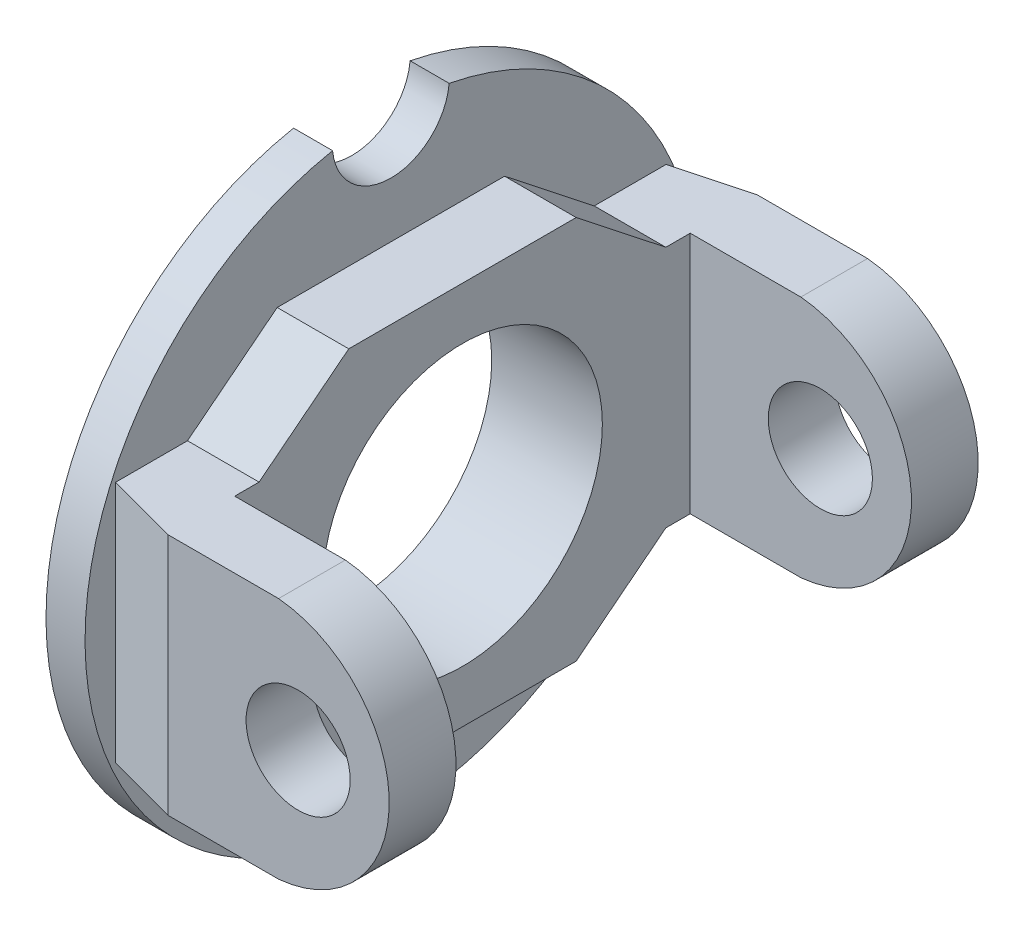
ISO-10303-21;
HEADER;
FILE_DESCRIPTION(('STEP AP214'),'2;1');
FILE_NAME('part.step','',(''),(''),'','','');
FILE_SCHEMA(('AUTOMOTIVE_DESIGN { 1 0 10303 214 1 1 1 1 }'));
ENDSEC;
DATA;
#1=APPLICATION_CONTEXT('core data for automotive mechanical design processes');
#2=APPLICATION_PROTOCOL_DEFINITION('international standard','automotive_design',2000,#1);
#3=PRODUCT_CONTEXT('',#1,'mechanical');
#4=PRODUCT('Part','Part','',(#3));
#5=PRODUCT_RELATED_PRODUCT_CATEGORY('part','',(#4));
#6=PRODUCT_DEFINITION_FORMATION('','',#4);
#7=PRODUCT_DEFINITION_CONTEXT('part definition',#1,'design');
#8=PRODUCT_DEFINITION('design','',#6,#7);
#9=PRODUCT_DEFINITION_SHAPE('','',#8);
#10=(LENGTH_UNIT() NAMED_UNIT(*) SI_UNIT(.MILLI.,.METRE.));
#11=(NAMED_UNIT(*) PLANE_ANGLE_UNIT() SI_UNIT($,.RADIAN.));
#12=(NAMED_UNIT(*) SI_UNIT($,.STERADIAN.) SOLID_ANGLE_UNIT());
#13=UNCERTAINTY_MEASURE_WITH_UNIT(LENGTH_MEASURE(1.E-05),#10,'distance_accuracy_value','');
#14=(GEOMETRIC_REPRESENTATION_CONTEXT(3) GLOBAL_UNCERTAINTY_ASSIGNED_CONTEXT((#13)) GLOBAL_UNIT_ASSIGNED_CONTEXT((#10,
#11,#12)) REPRESENTATION_CONTEXT('',''));
#15=CARTESIAN_POINT('',(0.,0.,0.));
#16=DIRECTION('',(0.,0.,1.));
#17=DIRECTION('',(1.,0.,0.));
#18=AXIS2_PLACEMENT_3D('',#15,#16,#17);
#19=CARTESIAN_POINT('',(25.5,-9.33718528888405,17.5));
#20=DIRECTION('',(0.,0.,1.));
#21=DIRECTION('',(1.,0.,0.));
#22=AXIS2_PLACEMENT_3D('',#19,#20,#21);
#23=PLANE('',#22);
#24=CARTESIAN_POINT('',(18.5,0.,17.5));
#25=DIRECTION('',(0.,0.,1.));
#26=DIRECTION('',(1.,0.,0.));
#27=AXIS2_PLACEMENT_3D('',#24,#25,#26);
#28=CIRCLE('',#27,4.);
#29=CARTESIAN_POINT('',(22.5,0.,17.5));
#30=VERTEX_POINT('',#29);
#31=EDGE_CURVE('E176',#30,#30,#28,.T.);
#32=ORIENTED_EDGE('',*,*,#31,.T.);
#33=EDGE_LOOP('',(#32));
#34=FACE_BOUND('',#33,.T.);
#35=DIRECTION('',(-1.,0.,0.));
#36=VECTOR('',#35,1.);
#37=CARTESIAN_POINT('',(25.5,9.33718528888406,17.5));
#38=LINE('',#37,#36);
#39=CARTESIAN_POINT('',(17.,9.33718528888406,17.5));
#40=VERTEX_POINT('',#39);
#41=CARTESIAN_POINT('',(8.5,9.33718528888406,17.5));
#42=VERTEX_POINT('',#41);
#43=EDGE_CURVE('E193',#40,#42,#38,.T.);
#44=ORIENTED_EDGE('',*,*,#43,.F.);
#45=CARTESIAN_POINT('',(16.1215865224145,0.,17.5));
#46=DIRECTION('',(0.,0.,1.));
#47=DIRECTION('',(1.,0.,0.));
#48=AXIS2_PLACEMENT_3D('',#45,#46,#47);
#49=CIRCLE('',#48,9.37841347758546);
#50=CARTESIAN_POINT('',(17.,-9.33718528888405,17.5));
#51=VERTEX_POINT('',#50);
#52=EDGE_CURVE('E344',#40,#51,#49,.F.);
#53=ORIENTED_EDGE('',*,*,#52,.T.);
#54=DIRECTION('',(-1.,0.,0.));
#55=VECTOR('',#54,1.);
#56=CARTESIAN_POINT('',(25.5,-9.33718528888405,17.5));
#57=LINE('',#56,#55);
#58=CARTESIAN_POINT('',(8.5,-9.33718528888405,17.5));
#59=VERTEX_POINT('',#58);
#60=EDGE_CURVE('E185',#51,#59,#57,.T.);
#61=ORIENTED_EDGE('',*,*,#60,.T.);
#62=DIRECTION('',(0.,1.,0.));
#63=VECTOR('',#62,1.);
#64=CARTESIAN_POINT('',(8.5,-9.33718528888405,17.5));
#65=LINE('',#64,#63);
#66=EDGE_CURVE('E195',#59,#42,#65,.T.);
#67=ORIENTED_EDGE('',*,*,#66,.T.);
#68=EDGE_LOOP('',(#44,#53,#61,#67));
#69=FACE_BOUND('',#68,.T.);
#70=ADVANCED_FACE('F34',(#34,#69),#23,.F.);
#71=CARTESIAN_POINT('',(25.5,9.33718528888406,22.6269136957705));
#72=DIRECTION('',(0.,0.,-1.));
#73=DIRECTION('',(0.,1.,0.));
#74=AXIS2_PLACEMENT_3D('',#71,#72,#73);
#75=PLANE('',#74);
#76=CARTESIAN_POINT('',(18.5,0.,22.6269136957705));
#77=DIRECTION('',(0.,0.,1.));
#78=DIRECTION('',(1.,0.,0.));
#79=AXIS2_PLACEMENT_3D('',#76,#77,#78);
#80=CIRCLE('',#79,4.);
#81=CARTESIAN_POINT('',(22.5,0.,22.6269136957705));
#82=VERTEX_POINT('',#81);
#83=EDGE_CURVE('E361',#82,#82,#80,.T.);
#84=ORIENTED_EDGE('',*,*,#83,.F.);
#85=EDGE_LOOP('',(#84));
#86=FACE_BOUND('',#85,.T.);
#87=DIRECTION('',(-1.,0.,0.));
#88=VECTOR('',#87,1.);
#89=CARTESIAN_POINT('',(25.5,-9.33718528888405,22.6269136957705));
#90=LINE('',#89,#88);
#91=CARTESIAN_POINT('',(17.,-9.33718528888405,22.6269136957705));
#92=VERTEX_POINT('',#91);
#93=CARTESIAN_POINT('',(8.5,-9.33718528888405,22.6269136957705));
#94=VERTEX_POINT('',#93);
#95=EDGE_CURVE('E182',#92,#94,#90,.T.);
#96=ORIENTED_EDGE('',*,*,#95,.F.);
#97=CARTESIAN_POINT('',(16.1215865224145,0.,22.6269136957705));
#98=DIRECTION('',(0.,0.,-1.));
#99=DIRECTION('',(-1.,0.,0.));
#100=AXIS2_PLACEMENT_3D('',#97,#98,#99);
#101=CIRCLE('',#100,9.37841347758546);
#102=CARTESIAN_POINT('',(17.,9.33718528888406,22.6269136957705));
#103=VERTEX_POINT('',#102);
#104=EDGE_CURVE('E49',#103,#92,#101,.T.);
#105=ORIENTED_EDGE('',*,*,#104,.F.);
#106=DIRECTION('',(-1.,0.,0.));
#107=VECTOR('',#106,1.);
#108=CARTESIAN_POINT('',(25.5,9.33718528888406,22.6269136957705));
#109=LINE('',#108,#107);
#110=CARTESIAN_POINT('',(8.5,9.33718528888406,22.6269136957705));
#111=VERTEX_POINT('',#110);
#112=EDGE_CURVE('E191',#103,#111,#109,.T.);
#113=ORIENTED_EDGE('',*,*,#112,.T.);
#114=DIRECTION('',(0.,-1.,0.));
#115=VECTOR('',#114,1.);
#116=CARTESIAN_POINT('',(8.5,0.,22.6269136957705));
#117=LINE('',#116,#115);
#118=EDGE_CURVE('E190',#111,#94,#117,.T.);
#119=ORIENTED_EDGE('',*,*,#118,.T.);
#120=EDGE_LOOP('',(#96,#105,#113,#119));
#121=FACE_BOUND('',#120,.T.);
#122=ADVANCED_FACE('F188',(#86,#121),#75,.F.);
#123=CARTESIAN_POINT('',(25.5,9.33718528888406,-17.5));
#124=DIRECTION('',(0.,0.,-1.));
#125=DIRECTION('',(0.,1.,0.));
#126=AXIS2_PLACEMENT_3D('',#123,#124,#125);
#127=PLANE('',#126);
#128=CARTESIAN_POINT('',(18.5,0.,-17.5));
#129=DIRECTION('',(0.,0.,-1.));
#130=DIRECTION('',(0.,1.,0.));
#131=AXIS2_PLACEMENT_3D('',#128,#129,#130);
#132=CIRCLE('',#131,4.);
#133=CARTESIAN_POINT('',(18.5,3.99999999999999,-17.5));
#134=VERTEX_POINT('',#133);
#135=EDGE_CURVE('E355',#134,#134,#132,.T.);
#136=ORIENTED_EDGE('',*,*,#135,.T.);
#137=EDGE_LOOP('',(#136));
#138=FACE_BOUND('',#137,.T.);
#139=DIRECTION('',(-1.,0.,0.));
#140=VECTOR('',#139,1.);
#141=CARTESIAN_POINT('',(25.5,-9.33718528888405,-17.5));
#142=LINE('',#141,#140);
#143=CARTESIAN_POINT('',(17.,-9.33718528888405,-17.5));
#144=VERTEX_POINT('',#143);
#145=CARTESIAN_POINT('',(8.5,-9.33718528888405,-17.5));
#146=VERTEX_POINT('',#145);
#147=EDGE_CURVE('E333',#144,#146,#142,.T.);
#148=ORIENTED_EDGE('',*,*,#147,.F.);
#149=CARTESIAN_POINT('',(16.1215865224145,0.,-17.5));
#150=DIRECTION('',(0.,0.,-1.));
#151=DIRECTION('',(0.,1.,0.));
#152=AXIS2_PLACEMENT_3D('',#149,#150,#151);
#153=CIRCLE('',#152,9.37841347758546);
#154=CARTESIAN_POINT('',(17.,9.33718528888406,-17.5));
#155=VERTEX_POINT('',#154);
#156=EDGE_CURVE('E346',#144,#155,#153,.F.);
#157=ORIENTED_EDGE('',*,*,#156,.T.);
#158=DIRECTION('',(-1.,0.,0.));
#159=VECTOR('',#158,1.);
#160=CARTESIAN_POINT('',(25.5,9.33718528888406,-17.5));
#161=LINE('',#160,#159);
#162=CARTESIAN_POINT('',(8.5,9.33718528888406,-17.5));
#163=VERTEX_POINT('',#162);
#164=EDGE_CURVE('E332',#155,#163,#161,.T.);
#165=ORIENTED_EDGE('',*,*,#164,.T.);
#166=DIRECTION('',(0.,-1.,0.));
#167=VECTOR('',#166,1.);
#168=CARTESIAN_POINT('',(8.5,9.33718528888406,-17.5));
#169=LINE('',#168,#167);
#170=EDGE_CURVE('E341',#163,#146,#169,.T.);
#171=ORIENTED_EDGE('',*,*,#170,.T.);
#172=EDGE_LOOP('',(#148,#157,#165,#171));
#173=FACE_BOUND('',#172,.T.);
#174=ADVANCED_FACE('F369',(#138,#173),#127,.F.);
#175=CARTESIAN_POINT('',(25.5,-9.33718528888405,-22.6269136957705));
#176=DIRECTION('',(0.,0.,1.));
#177=DIRECTION('',(0.,-1.,0.));
#178=AXIS2_PLACEMENT_3D('',#175,#176,#177);
#179=PLANE('',#178);
#180=CARTESIAN_POINT('',(18.5,0.,-22.6269136957705));
#181=DIRECTION('',(0.,0.,1.));
#182=DIRECTION('',(0.,-1.,0.));
#183=AXIS2_PLACEMENT_3D('',#180,#181,#182);
#184=CIRCLE('',#183,4.);
#185=CARTESIAN_POINT('',(18.5,-4.,-22.6269136957705));
#186=VERTEX_POINT('',#185);
#187=EDGE_CURVE('E358',#186,#186,#184,.F.);
#188=ORIENTED_EDGE('',*,*,#187,.F.);
#189=EDGE_LOOP('',(#188));
#190=FACE_BOUND('',#189,.T.);
#191=DIRECTION('',(-1.,0.,0.));
#192=VECTOR('',#191,1.);
#193=CARTESIAN_POINT('',(25.5,9.33718528888408,-22.6269136957705));
#194=LINE('',#193,#192);
#195=CARTESIAN_POINT('',(17.,9.33718528888406,-22.6269136957705));
#196=VERTEX_POINT('',#195);
#197=CARTESIAN_POINT('',(8.5,9.33718528888408,-22.6269136957705));
#198=VERTEX_POINT('',#197);
#199=EDGE_CURVE('E339',#196,#198,#194,.T.);
#200=ORIENTED_EDGE('',*,*,#199,.F.);
#201=CARTESIAN_POINT('',(16.1215865224145,0.,-22.6269136957705));
#202=DIRECTION('',(0.,0.,1.));
#203=DIRECTION('',(0.,-1.,0.));
#204=AXIS2_PLACEMENT_3D('',#201,#202,#203);
#205=CIRCLE('',#204,9.37841347758546);
#206=CARTESIAN_POINT('',(17.,-9.33718528888405,-22.6269136957705));
#207=VERTEX_POINT('',#206);
#208=EDGE_CURVE('E347',#207,#196,#205,.T.);
#209=ORIENTED_EDGE('',*,*,#208,.F.);
#210=DIRECTION('',(-1.,0.,0.));
#211=VECTOR('',#210,1.);
#212=CARTESIAN_POINT('',(25.5,-9.33718528888405,-22.6269136957705));
#213=LINE('',#212,#211);
#214=CARTESIAN_POINT('',(8.5,-9.33718528888405,-22.6269136957705));
#215=VERTEX_POINT('',#214);
#216=EDGE_CURVE('E337',#207,#215,#213,.T.);
#217=ORIENTED_EDGE('',*,*,#216,.T.);
#218=DIRECTION('',(0.,-1.,0.));
#219=VECTOR('',#218,1.);
#220=CARTESIAN_POINT('',(8.5,0.,-22.6269136957705));
#221=LINE('',#220,#219);
#222=EDGE_CURVE('E215',#198,#215,#221,.T.);
#223=ORIENTED_EDGE('',*,*,#222,.F.);
#224=EDGE_LOOP('',(#200,#209,#217,#223));
#225=FACE_BOUND('',#224,.T.);
#226=ADVANCED_FACE('F375',(#190,#225),#179,.F.);
#227=CARTESIAN_POINT('',(8.5,0.,0.));
#228=DIRECTION('',(1.,0.,0.));
#229=DIRECTION('',(0.,0.,-1.));
#230=AXIS2_PLACEMENT_3D('',#227,#228,#229);
#231=PLANE('',#230);
#232=CARTESIAN_POINT('',(8.5,0.,0.));
#233=DIRECTION('',(1.,0.,0.));
#234=DIRECTION('',(0.,0.,-1.));
#235=AXIS2_PLACEMENT_3D('',#232,#233,#234);
#236=CIRCLE('',#235,10.75);
#237=CARTESIAN_POINT('',(8.5,0.,-10.75));
#238=VERTEX_POINT('',#237);
#239=EDGE_CURVE('E234',#238,#238,#236,.F.);
#240=ORIENTED_EDGE('',*,*,#239,.T.);
#241=EDGE_LOOP('',(#240));
#242=FACE_BOUND('',#241,.T.);
#243=DIRECTION('',(0.,0.,1.));
#244=VECTOR('',#243,1.);
#245=CARTESIAN_POINT('',(8.5,-9.33718528888405,0.));
#246=LINE('',#245,#244);
#247=CARTESIAN_POINT('',(8.5,-9.33718528888405,-15.6269136957705));
#248=VERTEX_POINT('',#247);
#249=EDGE_CURVE('E213',#146,#248,#246,.T.);
#250=ORIENTED_EDGE('',*,*,#249,.F.);
#251=ORIENTED_EDGE('',*,*,#170,.F.);
#252=DIRECTION('',(0.,0.,-1.));
#253=VECTOR('',#252,1.);
#254=CARTESIAN_POINT('',(8.5,9.33718528888407,0.));
#255=LINE('',#254,#253);
#256=CARTESIAN_POINT('',(8.5,9.33718528888408,-15.6269136957705));
#257=VERTEX_POINT('',#256);
#258=EDGE_CURVE('E218',#257,#163,#255,.T.);
#259=ORIENTED_EDGE('',*,*,#258,.F.);
#260=DIRECTION('',(0.,-0.61847722366667,-0.785802725756005));
#261=VECTOR('',#260,1.);
#262=CARTESIAN_POINT('',(8.5,13.3602775448159,-10.5153966669996));
#263=LINE('',#262,#261);
#264=CARTESIAN_POINT('',(8.5,14.7601442287282,-8.73680399807028));
#265=VERTEX_POINT('',#264);
#266=EDGE_CURVE('E221',#265,#257,#263,.T.);
#267=ORIENTED_EDGE('',*,*,#266,.F.);
#268=DIRECTION('',(0.,0.,-1.));
#269=VECTOR('',#268,1.);
#270=CARTESIAN_POINT('',(8.5,14.7601442287282,0.));
#271=LINE('',#270,#269);
#272=CARTESIAN_POINT('',(8.5,14.7601442287282,8.73680399807029));
#273=VERTEX_POINT('',#272);
#274=EDGE_CURVE('E224',#273,#265,#271,.T.);
#275=ORIENTED_EDGE('',*,*,#274,.F.);
#276=DIRECTION('',(0.,0.618477223666671,-0.785802725756005));
#277=VECTOR('',#276,1.);
#278=CARTESIAN_POINT('',(8.5,13.3602775448159,10.5153966669996));
#279=LINE('',#278,#277);
#280=CARTESIAN_POINT('',(8.5,9.33718528888406,15.6269136957705));
#281=VERTEX_POINT('',#280);
#282=EDGE_CURVE('E227',#281,#273,#279,.T.);
#283=ORIENTED_EDGE('',*,*,#282,.F.);
#284=DIRECTION('',(0.,0.,1.));
#285=VECTOR('',#284,1.);
#286=CARTESIAN_POINT('',(8.5,9.33718528888407,0.));
#287=LINE('',#286,#285);
#288=EDGE_CURVE('E230',#281,#42,#287,.T.);
#289=ORIENTED_EDGE('',*,*,#288,.T.);
#290=ORIENTED_EDGE('',*,*,#66,.F.);
#291=DIRECTION('',(0.,0.,-1.));
#292=VECTOR('',#291,1.);
#293=CARTESIAN_POINT('',(8.5,-9.33718528888405,0.));
#294=LINE('',#293,#292);
#295=CARTESIAN_POINT('',(8.5,-9.33718528888405,15.6269136957705));
#296=VERTEX_POINT('',#295);
#297=EDGE_CURVE('E201',#59,#296,#294,.T.);
#298=ORIENTED_EDGE('',*,*,#297,.T.);
#299=DIRECTION('',(0.,0.618477223666672,0.785802725756004));
#300=VECTOR('',#299,1.);
#301=CARTESIAN_POINT('',(8.5,-13.3602775448159,10.5153966669996));
#302=LINE('',#301,#300);
#303=CARTESIAN_POINT('',(8.5,-14.7601442287282,8.73680399807028));
#304=VERTEX_POINT('',#303);
#305=EDGE_CURVE('E203',#304,#296,#302,.T.);
#306=ORIENTED_EDGE('',*,*,#305,.F.);
#307=DIRECTION('',(0.,0.,1.));
#308=VECTOR('',#307,1.);
#309=CARTESIAN_POINT('',(8.5,-14.7601442287282,0.));
#310=LINE('',#309,#308);
#311=CARTESIAN_POINT('',(8.5,-14.7601442287282,-8.73680399807029));
#312=VERTEX_POINT('',#311);
#313=EDGE_CURVE('E207',#312,#304,#310,.T.);
#314=ORIENTED_EDGE('',*,*,#313,.F.);
#315=DIRECTION('',(0.,-0.618477223666672,0.785802725756004));
#316=VECTOR('',#315,1.);
#317=CARTESIAN_POINT('',(8.5,-13.3602775448159,-10.5153966669996));
#318=LINE('',#317,#316);
#319=EDGE_CURVE('E210',#248,#312,#318,.T.);
#320=ORIENTED_EDGE('',*,*,#319,.F.);
#321=EDGE_LOOP('',(#250,#251,#259,#267,#275,#283,#289,#290,#298,#306,#314,#320));
#322=FACE_BOUND('',#321,.T.);
#323=ADVANCED_FACE('F325',(#242,#322),#231,.T.);
#324=CARTESIAN_POINT('',(3.,11.75,0.));
#325=DIRECTION('',(1.,0.,0.));
#326=DIRECTION('',(0.,0.,-1.));
#327=AXIS2_PLACEMENT_3D('',#324,#325,#326);
#328=PLANE('',#327);
#329=DIRECTION('',(0.,0.,-1.));
#330=VECTOR('',#329,1.);
#331=CARTESIAN_POINT('',(3.,-9.33718528888405,0.));
#332=LINE('',#331,#330);
#333=CARTESIAN_POINT('',(3.,-9.33718528888405,21.1531931373993));
#334=VERTEX_POINT('',#333);
#335=CARTESIAN_POINT('',(3.,-9.33718528888405,15.6269136957705));
#336=VERTEX_POINT('',#335);
#337=EDGE_CURVE('E238',#334,#336,#332,.T.);
#338=ORIENTED_EDGE('',*,*,#337,.F.);
#339=DIRECTION('',(0.,1.,0.));
#340=VECTOR('',#339,1.);
#341=CARTESIAN_POINT('',(3.,0.,21.1531931373993));
#342=LINE('',#341,#340);
#343=CARTESIAN_POINT('',(3.,9.33718528888406,21.1531931373993));
#344=VERTEX_POINT('',#343);
#345=EDGE_CURVE('E11',#344,#334,#342,.F.);
#346=ORIENTED_EDGE('',*,*,#345,.F.);
#347=DIRECTION('',(0.,0.,1.));
#348=VECTOR('',#347,1.);
#349=CARTESIAN_POINT('',(3.,9.33718528888407,0.));
#350=LINE('',#349,#348);
#351=CARTESIAN_POINT('',(3.,9.33718528888406,15.6269136957705));
#352=VERTEX_POINT('',#351);
#353=EDGE_CURVE('E204',#352,#344,#350,.T.);
#354=ORIENTED_EDGE('',*,*,#353,.F.);
#355=DIRECTION('',(0.,0.618477223666671,-0.785802725756005));
#356=VECTOR('',#355,1.);
#357=CARTESIAN_POINT('',(3.,13.3602775448159,10.5153966669996));
#358=LINE('',#357,#356);
#359=CARTESIAN_POINT('',(3.,14.7601442287282,8.73680399807029));
#360=VERTEX_POINT('',#359);
#361=EDGE_CURVE('E260',#352,#360,#358,.T.);
#362=ORIENTED_EDGE('',*,*,#361,.T.);
#363=DIRECTION('',(0.,0.,-1.));
#364=VECTOR('',#363,1.);
#365=CARTESIAN_POINT('',(3.,14.7601442287282,0.));
#366=LINE('',#365,#364);
#367=CARTESIAN_POINT('',(3.,14.7601442287282,-8.73680399807028));
#368=VERTEX_POINT('',#367);
#369=EDGE_CURVE('E257',#360,#368,#366,.T.);
#370=ORIENTED_EDGE('',*,*,#369,.T.);
#371=DIRECTION('',(0.,-0.61847722366667,-0.785802725756005));
#372=VECTOR('',#371,1.);
#373=CARTESIAN_POINT('',(3.,13.3602775448159,-10.5153966669996));
#374=LINE('',#373,#372);
#375=CARTESIAN_POINT('',(3.,9.33718528888408,-15.6269136957705));
#376=VERTEX_POINT('',#375);
#377=EDGE_CURVE('E254',#368,#376,#374,.T.);
#378=ORIENTED_EDGE('',*,*,#377,.T.);
#379=DIRECTION('',(0.,0.,-1.));
#380=VECTOR('',#379,1.);
#381=CARTESIAN_POINT('',(3.,9.33718528888407,0.));
#382=LINE('',#381,#380);
#383=CARTESIAN_POINT('',(3.,9.33718528888408,-21.1531931373993));
#384=VERTEX_POINT('',#383);
#385=EDGE_CURVE('E249',#376,#384,#382,.T.);
#386=ORIENTED_EDGE('',*,*,#385,.T.);
#387=DIRECTION('',(0.,-1.,0.));
#388=VECTOR('',#387,1.);
#389=CARTESIAN_POINT('',(3.,0.,-21.1531931373993));
#390=LINE('',#389,#388);
#391=CARTESIAN_POINT('',(3.,-9.33718528888405,-21.1531931373993));
#392=VERTEX_POINT('',#391);
#393=EDGE_CURVE('E42',#384,#392,#390,.T.);
#394=ORIENTED_EDGE('',*,*,#393,.T.);
#395=DIRECTION('',(0.,0.,1.));
#396=VECTOR('',#395,1.);
#397=CARTESIAN_POINT('',(3.,-9.33718528888405,0.));
#398=LINE('',#397,#396);
#399=CARTESIAN_POINT('',(3.,-9.33718528888405,-15.6269136957705));
#400=VERTEX_POINT('',#399);
#401=EDGE_CURVE('E240',#392,#400,#398,.T.);
#402=ORIENTED_EDGE('',*,*,#401,.T.);
#403=DIRECTION('',(0.,-0.618477223666672,0.785802725756004));
#404=VECTOR('',#403,1.);
#405=CARTESIAN_POINT('',(3.,-13.3602775448159,-10.5153966669996));
#406=LINE('',#405,#404);
#407=CARTESIAN_POINT('',(3.,-14.7601442287282,-8.73680399807029));
#408=VERTEX_POINT('',#407);
#409=EDGE_CURVE('E246',#400,#408,#406,.T.);
#410=ORIENTED_EDGE('',*,*,#409,.T.);
#411=DIRECTION('',(0.,0.,1.));
#412=VECTOR('',#411,1.);
#413=CARTESIAN_POINT('',(3.,-14.7601442287282,0.));
#414=LINE('',#413,#412);
#415=CARTESIAN_POINT('',(3.,-14.7601442287282,8.73680399807028));
#416=VERTEX_POINT('',#415);
#417=EDGE_CURVE('E243',#408,#416,#414,.T.);
#418=ORIENTED_EDGE('',*,*,#417,.T.);
#419=DIRECTION('',(0.,0.618477223666672,0.785802725756004));
#420=VECTOR('',#419,1.);
#421=CARTESIAN_POINT('',(3.,-13.3602775448159,10.5153966669996));
#422=LINE('',#421,#420);
#423=EDGE_CURVE('E200',#416,#336,#422,.T.);
#424=ORIENTED_EDGE('',*,*,#423,.T.);
#425=EDGE_LOOP('',(#338,#346,#354,#362,#370,#378,#386,#394,#402,#410,#418,#424));
#426=FACE_BOUND('',#425,.T.);
#427=CARTESIAN_POINT('',(3.,0.,0.));
#428=DIRECTION('',(1.,0.,0.));
#429=DIRECTION('',(0.,0.,-1.));
#430=AXIS2_PLACEMENT_3D('',#427,#428,#429);
#431=CIRCLE('',#430,23.5);
#432=CARTESIAN_POINT('',(3.,23.0691489361702,4.479326663774));
#433=VERTEX_POINT('',#432);
#434=CARTESIAN_POINT('',(3.,23.0691489361702,-4.47932666377399));
#435=VERTEX_POINT('',#434);
#436=EDGE_CURVE('E293',#433,#435,#431,.T.);
#437=ORIENTED_EDGE('',*,*,#436,.T.);
#438=CARTESIAN_POINT('',(3.,23.5,0.));
#439=DIRECTION('',(-1.,0.,0.));
#440=DIRECTION('',(0.,0.,-1.));
#441=AXIS2_PLACEMENT_3D('',#438,#439,#440);
#442=CIRCLE('',#441,4.5);
#443=EDGE_CURVE('E290',#435,#433,#442,.T.);
#444=ORIENTED_EDGE('',*,*,#443,.T.);
#445=EDGE_LOOP('',(#437,#444));
#446=FACE_BOUND('',#445,.T.);
#447=ADVANCED_FACE('F315',(#426,#446),#328,.T.);
#448=CARTESIAN_POINT('',(0.,11.75,0.));
#449=DIRECTION('',(1.,0.,0.));
#450=DIRECTION('',(0.,0.,-1.));
#451=AXIS2_PLACEMENT_3D('',#448,#449,#450);
#452=PLANE('',#451);
#453=CARTESIAN_POINT('',(0.,23.5,0.));
#454=DIRECTION('',(-1.,0.,0.));
#455=DIRECTION('',(0.,0.,-1.));
#456=AXIS2_PLACEMENT_3D('',#453,#454,#455);
#457=CIRCLE('',#456,4.5);
#458=CARTESIAN_POINT('',(0.,23.0691489361702,-4.47932666377399));
#459=VERTEX_POINT('',#458);
#460=CARTESIAN_POINT('',(0.,23.0691489361702,4.479326663774));
#461=VERTEX_POINT('',#460);
#462=EDGE_CURVE('E289',#459,#461,#457,.T.);
#463=ORIENTED_EDGE('',*,*,#462,.F.);
#464=CARTESIAN_POINT('',(0.,0.,0.));
#465=DIRECTION('',(1.,0.,0.));
#466=DIRECTION('',(0.,0.,-1.));
#467=AXIS2_PLACEMENT_3D('',#464,#465,#466);
#468=CIRCLE('',#467,23.5);
#469=EDGE_CURVE('E294',#461,#459,#468,.T.);
#470=ORIENTED_EDGE('',*,*,#469,.F.);
#471=EDGE_LOOP('',(#463,#470));
#472=FACE_BOUND('',#471,.T.);
#473=CARTESIAN_POINT('',(0.,0.,0.));
#474=DIRECTION('',(1.,0.,0.));
#475=DIRECTION('',(0.,0.,-1.));
#476=AXIS2_PLACEMENT_3D('',#473,#474,#475);
#477=CIRCLE('',#476,10.75);
#478=CARTESIAN_POINT('',(0.,0.,-10.75));
#479=VERTEX_POINT('',#478);
#480=EDGE_CURVE('E286',#479,#479,#477,.T.);
#481=ORIENTED_EDGE('',*,*,#480,.T.);
#482=EDGE_LOOP('',(#481));
#483=FACE_BOUND('',#482,.T.);
#484=ADVANCED_FACE('F429',(#472,#483),#452,.F.);
#485=CARTESIAN_POINT('',(3.,23.5,0.));
#486=DIRECTION('',(-1.,0.,0.));
#487=DIRECTION('',(0.,0.,1.));
#488=AXIS2_PLACEMENT_3D('',#485,#486,#487);
#489=CYLINDRICAL_SURFACE('',#488,4.5);
#490=ORIENTED_EDGE('',*,*,#462,.T.);
#491=DIRECTION('',(-1.,0.,0.));
#492=VECTOR('',#491,1.);
#493=CARTESIAN_POINT('',(3.,23.0691489361702,4.479326663774));
#494=LINE('',#493,#492);
#495=EDGE_CURVE('E252',#433,#461,#494,.T.);
#496=ORIENTED_EDGE('',*,*,#495,.F.);
#497=ORIENTED_EDGE('',*,*,#443,.F.);
#498=DIRECTION('',(-1.,0.,0.));
#499=VECTOR('',#498,1.);
#500=CARTESIAN_POINT('',(3.,23.0691489361702,-4.47932666377399));
#501=LINE('',#500,#499);
#502=EDGE_CURVE('E296',#435,#459,#501,.T.);
#503=ORIENTED_EDGE('',*,*,#502,.T.);
#504=EDGE_LOOP('',(#490,#496,#497,#503));
#505=FACE_BOUND('',#504,.T.);
#506=ADVANCED_FACE('F432',(#505),#489,.F.);
#507=CARTESIAN_POINT('',(3.,0.,0.));
#508=DIRECTION('',(-1.,0.,0.));
#509=DIRECTION('',(0.,0.,1.));
#510=AXIS2_PLACEMENT_3D('',#507,#508,#509);
#511=CYLINDRICAL_SURFACE('',#510,23.5);
#512=ORIENTED_EDGE('',*,*,#469,.T.);
#513=ORIENTED_EDGE('',*,*,#502,.F.);
#514=ORIENTED_EDGE('',*,*,#436,.F.);
#515=ORIENTED_EDGE('',*,*,#495,.T.);
#516=EDGE_LOOP('',(#512,#513,#514,#515));
#517=FACE_BOUND('',#516,.T.);
#518=ADVANCED_FACE('F425',(#517),#511,.T.);
#519=CARTESIAN_POINT('',(3.,0.,0.));
#520=DIRECTION('',(-1.,0.,0.));
#521=DIRECTION('',(0.,0.,1.));
#522=AXIS2_PLACEMENT_3D('',#519,#520,#521);
#523=CYLINDRICAL_SURFACE('',#522,10.75);
#524=ORIENTED_EDGE('',*,*,#480,.F.);
#525=EDGE_LOOP('',(#524));
#526=FACE_BOUND('',#525,.T.);
#527=ORIENTED_EDGE('',*,*,#239,.F.);
#528=EDGE_LOOP('',(#527));
#529=FACE_BOUND('',#528,.T.);
#530=ADVANCED_FACE('F422',(#526,#529),#523,.F.);
#531=CARTESIAN_POINT('',(8.5,-9.33718528888405,0.));
#532=DIRECTION('',(0.,1.,0.));
#533=DIRECTION('',(0.,0.,1.));
#534=AXIS2_PLACEMENT_3D('',#531,#532,#533);
#535=PLANE('',#534);
#536=ORIENTED_EDGE('',*,*,#60,.F.);
#537=DIRECTION('',(0.,0.,1.));
#538=VECTOR('',#537,1.);
#539=CARTESIAN_POINT('',(17.,-9.33718528888405,-51.4237210280911));
#540=LINE('',#539,#538);
#541=EDGE_CURVE('E171',#51,#92,#540,.T.);
#542=ORIENTED_EDGE('',*,*,#541,.T.);
#543=ORIENTED_EDGE('',*,*,#95,.T.);
#544=DIRECTION('',(0.965925826289068,0.,0.258819045102521));
#545=VECTOR('',#544,1.);
#546=CARTESIAN_POINT('',(2.84327157605737,-9.33718528888405,21.1111978827729));
#547=LINE('',#546,#545);
#548=EDGE_CURVE('E237',#94,#334,#547,.F.);
#549=ORIENTED_EDGE('',*,*,#548,.T.);
#550=ORIENTED_EDGE('',*,*,#337,.T.);
#551=DIRECTION('',(-1.,0.,0.));
#552=VECTOR('',#551,1.);
#553=CARTESIAN_POINT('',(8.5,-9.33718528888405,15.6269136957705));
#554=LINE('',#553,#552);
#555=EDGE_CURVE('E283',#296,#336,#554,.T.);
#556=ORIENTED_EDGE('',*,*,#555,.F.);
#557=ORIENTED_EDGE('',*,*,#297,.F.);
#558=EDGE_LOOP('',(#536,#542,#543,#549,#550,#556,#557));
#559=FACE_BOUND('',#558,.T.);
#560=ADVANCED_FACE('F180',(#559),#535,.F.);
#561=CARTESIAN_POINT('',(8.5,-13.3602775448159,10.5153966669996));
#562=DIRECTION('',(0.,-0.785802725756004,0.618477223666672));
#563=DIRECTION('',(0.,-0.618477223666672,-0.785802725756004));
#564=AXIS2_PLACEMENT_3D('',#561,#562,#563);
#565=PLANE('',#564);
#566=ORIENTED_EDGE('',*,*,#423,.F.);
#567=DIRECTION('',(-1.,0.,0.));
#568=VECTOR('',#567,1.);
#569=CARTESIAN_POINT('',(8.5,-14.7601442287282,8.73680399807028));
#570=LINE('',#569,#568);
#571=EDGE_CURVE('E281',#304,#416,#570,.T.);
#572=ORIENTED_EDGE('',*,*,#571,.F.);
#573=ORIENTED_EDGE('',*,*,#305,.T.);
#574=ORIENTED_EDGE('',*,*,#555,.T.);
#575=EDGE_LOOP('',(#566,#572,#573,#574));
#576=FACE_BOUND('',#575,.T.);
#577=ADVANCED_FACE('F320',(#576),#565,.T.);
#578=CARTESIAN_POINT('',(8.5,-14.7601442287282,0.));
#579=DIRECTION('',(0.,-1.,0.));
#580=DIRECTION('',(0.,0.,-1.));
#581=AXIS2_PLACEMENT_3D('',#578,#579,#580);
#582=PLANE('',#581);
#583=ORIENTED_EDGE('',*,*,#417,.F.);
#584=DIRECTION('',(-1.,0.,0.));
#585=VECTOR('',#584,1.);
#586=CARTESIAN_POINT('',(8.5,-14.7601442287282,-8.73680399807029));
#587=LINE('',#586,#585);
#588=EDGE_CURVE('E278',#312,#408,#587,.T.);
#589=ORIENTED_EDGE('',*,*,#588,.F.);
#590=ORIENTED_EDGE('',*,*,#313,.T.);
#591=ORIENTED_EDGE('',*,*,#571,.T.);
#592=EDGE_LOOP('',(#583,#589,#590,#591));
#593=FACE_BOUND('',#592,.T.);
#594=ADVANCED_FACE('F413',(#593),#582,.T.);
#595=CARTESIAN_POINT('',(8.5,-13.3602775448159,-10.5153966669996));
#596=DIRECTION('',(0.,-0.785802725756004,-0.618477223666672));
#597=DIRECTION('',(0.,0.618477223666672,-0.785802725756004));
#598=AXIS2_PLACEMENT_3D('',#595,#596,#597);
#599=PLANE('',#598);
#600=ORIENTED_EDGE('',*,*,#409,.F.);
#601=DIRECTION('',(-1.,0.,0.));
#602=VECTOR('',#601,1.);
#603=CARTESIAN_POINT('',(8.5,-9.33718528888405,-15.6269136957705));
#604=LINE('',#603,#602);
#605=EDGE_CURVE('E276',#248,#400,#604,.T.);
#606=ORIENTED_EDGE('',*,*,#605,.F.);
#607=ORIENTED_EDGE('',*,*,#319,.T.);
#608=ORIENTED_EDGE('',*,*,#588,.T.);
#609=EDGE_LOOP('',(#600,#606,#607,#608));
#610=FACE_BOUND('',#609,.T.);
#611=ADVANCED_FACE('F409',(#610),#599,.T.);
#612=CARTESIAN_POINT('',(8.5,-9.33718528888405,0.));
#613=DIRECTION('',(0.,-1.,0.));
#614=DIRECTION('',(0.,0.,-1.));
#615=AXIS2_PLACEMENT_3D('',#612,#613,#614);
#616=PLANE('',#615);
#617=EDGE_CURVE('E57',#207,#144,#540,.T.);
#618=ORIENTED_EDGE('',*,*,#617,.T.);
#619=ORIENTED_EDGE('',*,*,#147,.T.);
#620=ORIENTED_EDGE('',*,*,#249,.T.);
#621=ORIENTED_EDGE('',*,*,#605,.T.);
#622=ORIENTED_EDGE('',*,*,#401,.F.);
#623=DIRECTION('',(-0.965925826289068,0.,0.258819045102521));
#624=VECTOR('',#623,1.);
#625=CARTESIAN_POINT('',(8.5,-9.33718528888405,-22.6269136957705));
#626=LINE('',#625,#624);
#627=EDGE_CURVE('E279',#215,#392,#626,.T.);
#628=ORIENTED_EDGE('',*,*,#627,.F.);
#629=ORIENTED_EDGE('',*,*,#216,.F.);
#630=EDGE_LOOP('',(#618,#619,#620,#621,#622,#628,#629));
#631=FACE_BOUND('',#630,.T.);
#632=ADVANCED_FACE('F406',(#631),#616,.T.);
#633=CARTESIAN_POINT('',(8.5,0.,-22.6269136957705));
#634=DIRECTION('',(-0.258819045102521,0.,-0.965925826289068));
#635=DIRECTION('',(-0.965925826289068,0.,0.258819045102521));
#636=AXIS2_PLACEMENT_3D('',#633,#634,#635);
#637=PLANE('',#636);
#638=ORIENTED_EDGE('',*,*,#627,.T.);
#639=ORIENTED_EDGE('',*,*,#393,.F.);
#640=DIRECTION('',(-0.965925826289068,0.,0.258819045102521));
#641=VECTOR('',#640,1.);
#642=CARTESIAN_POINT('',(2.84327157605737,9.33718528888408,-21.1111978827729));
#643=LINE('',#642,#641);
#644=EDGE_CURVE('E275',#198,#384,#643,.T.);
#645=ORIENTED_EDGE('',*,*,#644,.F.);
#646=ORIENTED_EDGE('',*,*,#222,.T.);
#647=EDGE_LOOP('',(#638,#639,#645,#646));
#648=FACE_BOUND('',#647,.T.);
#649=ADVANCED_FACE('F404',(#648),#637,.T.);
#650=CARTESIAN_POINT('',(8.5,9.33718528888407,0.));
#651=DIRECTION('',(0.,1.,0.));
#652=DIRECTION('',(0.,0.,1.));
#653=AXIS2_PLACEMENT_3D('',#650,#651,#652);
#654=PLANE('',#653);
#655=DIRECTION('',(0.,0.,1.));
#656=VECTOR('',#655,1.);
#657=CARTESIAN_POINT('',(17.,9.33718528888406,-51.4237210280911));
#658=LINE('',#657,#656);
#659=EDGE_CURVE('E349',#196,#155,#658,.T.);
#660=ORIENTED_EDGE('',*,*,#659,.F.);
#661=ORIENTED_EDGE('',*,*,#199,.T.);
#662=ORIENTED_EDGE('',*,*,#644,.T.);
#663=ORIENTED_EDGE('',*,*,#385,.F.);
#664=DIRECTION('',(-1.,0.,0.));
#665=VECTOR('',#664,1.);
#666=CARTESIAN_POINT('',(8.5,9.33718528888408,-15.6269136957705));
#667=LINE('',#666,#665);
#668=EDGE_CURVE('E272',#257,#376,#667,.T.);
#669=ORIENTED_EDGE('',*,*,#668,.F.);
#670=ORIENTED_EDGE('',*,*,#258,.T.);
#671=ORIENTED_EDGE('',*,*,#164,.F.);
#672=EDGE_LOOP('',(#660,#661,#662,#663,#669,#670,#671));
#673=FACE_BOUND('',#672,.T.);
#674=ADVANCED_FACE('F400',(#673),#654,.T.);
#675=CARTESIAN_POINT('',(8.5,13.3602775448159,-10.5153966669996));
#676=DIRECTION('',(0.,0.785802725756005,-0.61847722366667));
#677=DIRECTION('',(0.,0.61847722366667,0.785802725756005));
#678=AXIS2_PLACEMENT_3D('',#675,#676,#677);
#679=PLANE('',#678);
#680=ORIENTED_EDGE('',*,*,#377,.F.);
#681=DIRECTION('',(-1.,0.,0.));
#682=VECTOR('',#681,1.);
#683=CARTESIAN_POINT('',(8.5,14.7601442287282,-8.73680399807028));
#684=LINE('',#683,#682);
#685=EDGE_CURVE('E270',#265,#368,#684,.T.);
#686=ORIENTED_EDGE('',*,*,#685,.F.);
#687=ORIENTED_EDGE('',*,*,#266,.T.);
#688=ORIENTED_EDGE('',*,*,#668,.T.);
#689=EDGE_LOOP('',(#680,#686,#687,#688));
#690=FACE_BOUND('',#689,.T.);
#691=ADVANCED_FACE('F396',(#690),#679,.T.);
#692=CARTESIAN_POINT('',(8.5,14.7601442287282,0.));
#693=DIRECTION('',(0.,1.,0.));
#694=DIRECTION('',(0.,0.,1.));
#695=AXIS2_PLACEMENT_3D('',#692,#693,#694);
#696=PLANE('',#695);
#697=ORIENTED_EDGE('',*,*,#369,.F.);
#698=DIRECTION('',(-1.,0.,0.));
#699=VECTOR('',#698,1.);
#700=CARTESIAN_POINT('',(8.5,14.7601442287282,8.73680399807029));
#701=LINE('',#700,#699);
#702=EDGE_CURVE('E267',#273,#360,#701,.T.);
#703=ORIENTED_EDGE('',*,*,#702,.F.);
#704=ORIENTED_EDGE('',*,*,#274,.T.);
#705=ORIENTED_EDGE('',*,*,#685,.T.);
#706=EDGE_LOOP('',(#697,#703,#704,#705));
#707=FACE_BOUND('',#706,.T.);
#708=ADVANCED_FACE('F392',(#707),#696,.T.);
#709=CARTESIAN_POINT('',(8.5,13.3602775448159,10.5153966669996));
#710=DIRECTION('',(0.,0.785802725756005,0.61847722366667));
#711=DIRECTION('',(0.,-0.61847722366667,0.785802725756005));
#712=AXIS2_PLACEMENT_3D('',#709,#710,#711);
#713=PLANE('',#712);
#714=ORIENTED_EDGE('',*,*,#361,.F.);
#715=DIRECTION('',(-1.,0.,0.));
#716=VECTOR('',#715,1.);
#717=CARTESIAN_POINT('',(8.5,9.33718528888406,15.6269136957705));
#718=LINE('',#717,#716);
#719=EDGE_CURVE('E265',#281,#352,#718,.T.);
#720=ORIENTED_EDGE('',*,*,#719,.F.);
#721=ORIENTED_EDGE('',*,*,#282,.T.);
#722=ORIENTED_EDGE('',*,*,#702,.T.);
#723=EDGE_LOOP('',(#714,#720,#721,#722));
#724=FACE_BOUND('',#723,.T.);
#725=ADVANCED_FACE('F388',(#724),#713,.T.);
#726=CARTESIAN_POINT('',(8.5,9.33718528888407,0.));
#727=DIRECTION('',(0.,-1.,0.));
#728=DIRECTION('',(0.,0.,-1.));
#729=AXIS2_PLACEMENT_3D('',#726,#727,#728);
#730=PLANE('',#729);
#731=ORIENTED_EDGE('',*,*,#112,.F.);
#732=EDGE_CURVE('E174',#40,#103,#658,.T.);
#733=ORIENTED_EDGE('',*,*,#732,.F.);
#734=ORIENTED_EDGE('',*,*,#43,.T.);
#735=ORIENTED_EDGE('',*,*,#288,.F.);
#736=ORIENTED_EDGE('',*,*,#719,.T.);
#737=ORIENTED_EDGE('',*,*,#353,.T.);
#738=DIRECTION('',(0.965925826289068,0.,0.258819045102521));
#739=VECTOR('',#738,1.);
#740=CARTESIAN_POINT('',(8.5,9.33718528888406,22.6269136957705));
#741=LINE('',#740,#739);
#742=EDGE_CURVE('E268',#111,#344,#741,.F.);
#743=ORIENTED_EDGE('',*,*,#742,.F.);
#744=EDGE_LOOP('',(#731,#733,#734,#735,#736,#737,#743));
#745=FACE_BOUND('',#744,.T.);
#746=ADVANCED_FACE('F385',(#745),#730,.F.);
#747=CARTESIAN_POINT('',(8.5,0.,22.6269136957705));
#748=DIRECTION('',(-0.258819045102521,0.,0.965925826289068));
#749=DIRECTION('',(0.965925826289068,0.,0.258819045102521));
#750=AXIS2_PLACEMENT_3D('',#747,#748,#749);
#751=PLANE('',#750);
#752=ORIENTED_EDGE('',*,*,#742,.T.);
#753=ORIENTED_EDGE('',*,*,#345,.T.);
#754=ORIENTED_EDGE('',*,*,#548,.F.);
#755=ORIENTED_EDGE('',*,*,#118,.F.);
#756=EDGE_LOOP('',(#752,#753,#754,#755));
#757=FACE_BOUND('',#756,.T.);
#758=ADVANCED_FACE('F36',(#757),#751,.T.);
#759=CARTESIAN_POINT('',(16.1215865224145,0.,-51.4237210280911));
#760=DIRECTION('',(0.,0.,1.));
#761=DIRECTION('',(1.,0.,0.));
#762=AXIS2_PLACEMENT_3D('',#759,#760,#761);
#763=CYLINDRICAL_SURFACE('',#762,9.37841347758546);
#764=ORIENTED_EDGE('',*,*,#617,.F.);
#765=ORIENTED_EDGE('',*,*,#208,.T.);
#766=ORIENTED_EDGE('',*,*,#659,.T.);
#767=ORIENTED_EDGE('',*,*,#156,.F.);
#768=EDGE_LOOP('',(#764,#765,#766,#767));
#769=FACE_BOUND('',#768,.T.);
#770=ADVANCED_FACE('F463',(#769),#763,.T.);
#771=ORIENTED_EDGE('',*,*,#52,.F.);
#772=ORIENTED_EDGE('',*,*,#732,.T.);
#773=ORIENTED_EDGE('',*,*,#104,.T.);
#774=ORIENTED_EDGE('',*,*,#541,.F.);
#775=EDGE_LOOP('',(#771,#772,#773,#774));
#776=FACE_BOUND('',#775,.T.);
#777=ADVANCED_FACE('F170',(#776),#763,.T.);
#778=CARTESIAN_POINT('',(18.5,0.,-33.9406221947552));
#779=DIRECTION('',(0.,0.,1.));
#780=DIRECTION('',(1.,0.,0.));
#781=AXIS2_PLACEMENT_3D('',#778,#779,#780);
#782=CYLINDRICAL_SURFACE('',#781,4.);
#783=ORIENTED_EDGE('',*,*,#187,.T.);
#784=EDGE_LOOP('',(#783));
#785=FACE_BOUND('',#784,.T.);
#786=ORIENTED_EDGE('',*,*,#135,.F.);
#787=EDGE_LOOP('',(#786));
#788=FACE_BOUND('',#787,.T.);
#789=ADVANCED_FACE('F474',(#785,#788),#782,.F.);
#790=ORIENTED_EDGE('',*,*,#83,.T.);
#791=EDGE_LOOP('',(#790));
#792=FACE_BOUND('',#791,.T.);
#793=ORIENTED_EDGE('',*,*,#31,.F.);
#794=EDGE_LOOP('',(#793));
#795=FACE_BOUND('',#794,.T.);
#796=ADVANCED_FACE('F365',(#792,#795),#782,.F.);
#797=CLOSED_SHELL('',(#70,#122,#174,#226,#323,#447,#484,#506,#518,#530,#560,#577,#594,#611,#632,
#649,#674,#691,#708,#725,#746,#758,#770,#777,#789,#796));
#798=MANIFOLD_SOLID_BREP('B2',#797);
#799=ADVANCED_BREP_SHAPE_REPRESENTATION('',(#18,#798),#14);
#800=SHAPE_DEFINITION_REPRESENTATION(#9,#799);
ENDSEC;
END-ISO-10303-21;
